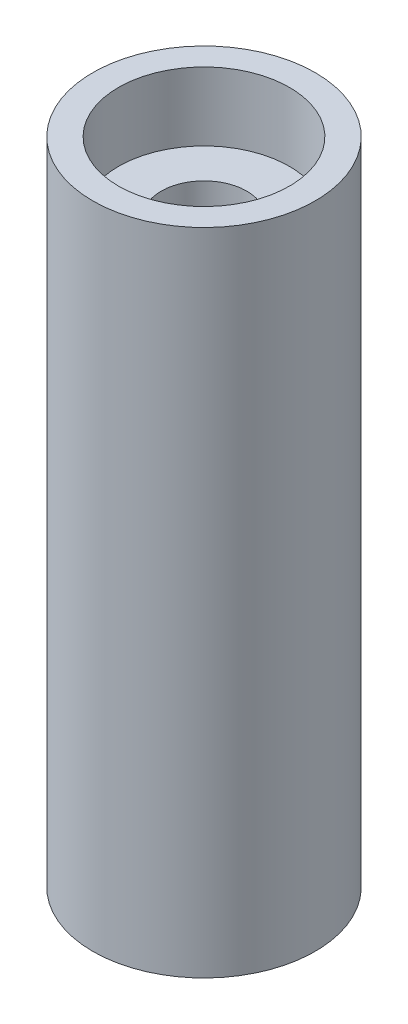
ISO-10303-21;
HEADER;
FILE_DESCRIPTION(('STEP AP214'),'2;1');
FILE_NAME('part.step','',(''),(''),'','','');
FILE_SCHEMA(('AUTOMOTIVE_DESIGN { 1 0 10303 214 1 1 1 1 }'));
ENDSEC;
DATA;
#1=APPLICATION_CONTEXT('core data for automotive mechanical design processes');
#2=APPLICATION_PROTOCOL_DEFINITION('international standard','automotive_design',2000,#1);
#3=PRODUCT_CONTEXT('',#1,'mechanical');
#4=PRODUCT('Part','Part','',(#3));
#5=PRODUCT_RELATED_PRODUCT_CATEGORY('part','',(#4));
#6=PRODUCT_DEFINITION_FORMATION('','',#4);
#7=PRODUCT_DEFINITION_CONTEXT('part definition',#1,'design');
#8=PRODUCT_DEFINITION('design','',#6,#7);
#9=PRODUCT_DEFINITION_SHAPE('','',#8);
#10=(LENGTH_UNIT() NAMED_UNIT(*) SI_UNIT(.MILLI.,.METRE.));
#11=(NAMED_UNIT(*) PLANE_ANGLE_UNIT() SI_UNIT($,.RADIAN.));
#12=(NAMED_UNIT(*) SI_UNIT($,.STERADIAN.) SOLID_ANGLE_UNIT());
#13=UNCERTAINTY_MEASURE_WITH_UNIT(LENGTH_MEASURE(1.E-05),#10,'distance_accuracy_value','');
#14=(GEOMETRIC_REPRESENTATION_CONTEXT(3) GLOBAL_UNCERTAINTY_ASSIGNED_CONTEXT((#13)) GLOBAL_UNIT_ASSIGNED_CONTEXT((#10,
#11,#12)) REPRESENTATION_CONTEXT('',''));
#15=CARTESIAN_POINT('',(0.,0.,0.));
#16=DIRECTION('',(0.,0.,1.));
#17=DIRECTION('',(1.,0.,0.));
#18=AXIS2_PLACEMENT_3D('',#15,#16,#17);
#19=CARTESIAN_POINT('',(0.,19.,0.));
#20=DIRECTION('',(0.,-1.,0.));
#21=DIRECTION('',(0.,0.,-1.));
#22=AXIS2_PLACEMENT_3D('',#19,#20,#21);
#23=CYLINDRICAL_SURFACE('',#22,2.5);
#24=CARTESIAN_POINT('',(0.,15.,0.));
#25=DIRECTION('',(0.,1.,0.));
#26=DIRECTION('',(0.,0.,1.));
#27=AXIS2_PLACEMENT_3D('',#24,#25,#26);
#28=CIRCLE('',#27,2.5);
#29=CARTESIAN_POINT('',(0.,15.,2.5));
#30=VERTEX_POINT('',#29);
#31=EDGE_CURVE('E54',#30,#30,#28,.T.);
#32=ORIENTED_EDGE('',*,*,#31,.T.);
#33=EDGE_LOOP('',(#32));
#34=FACE_BOUND('',#33,.T.);
#35=CARTESIAN_POINT('',(0.,-15.,0.));
#36=DIRECTION('',(0.,-1.,0.));
#37=DIRECTION('',(0.,0.,-1.));
#38=AXIS2_PLACEMENT_3D('',#35,#36,#37);
#39=CIRCLE('',#38,2.5);
#40=CARTESIAN_POINT('',(0.,-15.,-2.5));
#41=VERTEX_POINT('',#40);
#42=EDGE_CURVE('E42',#41,#41,#39,.T.);
#43=ORIENTED_EDGE('',*,*,#42,.T.);
#44=EDGE_LOOP('',(#43));
#45=FACE_BOUND('',#44,.T.);
#46=ADVANCED_FACE('F38',(#34,#45),#23,.F.);
#47=CARTESIAN_POINT('',(0.,-19.,0.));
#48=DIRECTION('',(0.,1.,0.));
#49=DIRECTION('',(0.,0.,1.));
#50=AXIS2_PLACEMENT_3D('',#47,#48,#49);
#51=PLANE('',#50);
#52=CARTESIAN_POINT('',(0.,-19.,0.));
#53=DIRECTION('',(0.,1.,0.));
#54=DIRECTION('',(0.,0.,1.));
#55=AXIS2_PLACEMENT_3D('',#52,#53,#54);
#56=CIRCLE('',#55,6.5);
#57=CARTESIAN_POINT('',(0.,-19.,6.5));
#58=VERTEX_POINT('',#57);
#59=EDGE_CURVE('E47',#58,#58,#56,.T.);
#60=ORIENTED_EDGE('',*,*,#59,.F.);
#61=EDGE_LOOP('',(#60));
#62=FACE_BOUND('',#61,.T.);
#63=CARTESIAN_POINT('',(0.,-19.,0.));
#64=DIRECTION('',(0.,1.,0.));
#65=DIRECTION('',(0.,0.,1.));
#66=AXIS2_PLACEMENT_3D('',#63,#64,#65);
#67=CIRCLE('',#66,5.);
#68=CARTESIAN_POINT('',(0.,-19.,5.));
#69=VERTEX_POINT('',#68);
#70=EDGE_CURVE('E72',#69,#69,#67,.T.);
#71=ORIENTED_EDGE('',*,*,#70,.T.);
#72=EDGE_LOOP('',(#71));
#73=FACE_BOUND('',#72,.T.);
#74=ADVANCED_FACE('F95',(#62,#73),#51,.F.);
#75=CARTESIAN_POINT('',(0.,19.,0.));
#76=DIRECTION('',(0.,1.,0.));
#77=DIRECTION('',(0.,0.,1.));
#78=AXIS2_PLACEMENT_3D('',#75,#76,#77);
#79=PLANE('',#78);
#80=CARTESIAN_POINT('',(0.,19.,0.));
#81=DIRECTION('',(0.,1.,0.));
#82=DIRECTION('',(0.,0.,1.));
#83=AXIS2_PLACEMENT_3D('',#80,#81,#82);
#84=CIRCLE('',#83,5.);
#85=CARTESIAN_POINT('',(0.,19.,5.));
#86=VERTEX_POINT('',#85);
#87=EDGE_CURVE('E57',#86,#86,#84,.T.);
#88=ORIENTED_EDGE('',*,*,#87,.F.);
#89=EDGE_LOOP('',(#88));
#90=FACE_BOUND('',#89,.T.);
#91=CARTESIAN_POINT('',(0.,19.,0.));
#92=DIRECTION('',(0.,1.,0.));
#93=DIRECTION('',(0.,0.,1.));
#94=AXIS2_PLACEMENT_3D('',#91,#92,#93);
#95=CIRCLE('',#94,6.5);
#96=CARTESIAN_POINT('',(0.,19.,6.5));
#97=VERTEX_POINT('',#96);
#98=EDGE_CURVE('E10',#97,#97,#95,.T.);
#99=ORIENTED_EDGE('',*,*,#98,.T.);
#100=EDGE_LOOP('',(#99));
#101=FACE_BOUND('',#100,.T.);
#102=ADVANCED_FACE('F100',(#90,#101),#79,.T.);
#103=CARTESIAN_POINT('',(0.,19.,0.));
#104=DIRECTION('',(0.,-1.,0.));
#105=DIRECTION('',(0.,0.,-1.));
#106=AXIS2_PLACEMENT_3D('',#103,#104,#105);
#107=CYLINDRICAL_SURFACE('',#106,6.5);
#108=ORIENTED_EDGE('',*,*,#98,.F.);
#109=EDGE_LOOP('',(#108));
#110=FACE_BOUND('',#109,.T.);
#111=ORIENTED_EDGE('',*,*,#59,.T.);
#112=EDGE_LOOP('',(#111));
#113=FACE_BOUND('',#112,.T.);
#114=ADVANCED_FACE('F40',(#110,#113),#107,.T.);
#115=CARTESIAN_POINT('',(0.,15.,0.));
#116=DIRECTION('',(0.,1.,0.));
#117=DIRECTION('',(0.,0.,1.));
#118=AXIS2_PLACEMENT_3D('',#115,#116,#117);
#119=CYLINDRICAL_SURFACE('',#118,5.);
#120=CARTESIAN_POINT('',(0.,15.,0.));
#121=DIRECTION('',(0.,1.,0.));
#122=DIRECTION('',(0.,0.,1.));
#123=AXIS2_PLACEMENT_3D('',#120,#121,#122);
#124=CIRCLE('',#123,5.);
#125=CARTESIAN_POINT('',(0.,15.,5.));
#126=VERTEX_POINT('',#125);
#127=EDGE_CURVE('E61',#126,#126,#124,.T.);
#128=ORIENTED_EDGE('',*,*,#127,.F.);
#129=EDGE_LOOP('',(#128));
#130=FACE_BOUND('',#129,.T.);
#131=ORIENTED_EDGE('',*,*,#87,.T.);
#132=EDGE_LOOP('',(#131));
#133=FACE_BOUND('',#132,.T.);
#134=ADVANCED_FACE('F104',(#130,#133),#119,.F.);
#135=CARTESIAN_POINT('',(0.,15.,0.));
#136=DIRECTION('',(0.,1.,0.));
#137=DIRECTION('',(0.,0.,1.));
#138=AXIS2_PLACEMENT_3D('',#135,#136,#137);
#139=PLANE('',#138);
#140=ORIENTED_EDGE('',*,*,#31,.F.);
#141=EDGE_LOOP('',(#140));
#142=FACE_BOUND('',#141,.T.);
#143=ORIENTED_EDGE('',*,*,#127,.T.);
#144=EDGE_LOOP('',(#143));
#145=FACE_BOUND('',#144,.T.);
#146=ADVANCED_FACE('F92',(#142,#145),#139,.T.);
#147=CARTESIAN_POINT('',(0.,-15.,0.));
#148=DIRECTION('',(0.,-1.,0.));
#149=DIRECTION('',(0.,0.,-1.));
#150=AXIS2_PLACEMENT_3D('',#147,#148,#149);
#151=CYLINDRICAL_SURFACE('',#150,5.);
#152=CARTESIAN_POINT('',(0.,-15.,0.));
#153=DIRECTION('',(0.,1.,0.));
#154=DIRECTION('',(0.,0.,1.));
#155=AXIS2_PLACEMENT_3D('',#152,#153,#154);
#156=CIRCLE('',#155,5.);
#157=CARTESIAN_POINT('',(0.,-15.,5.));
#158=VERTEX_POINT('',#157);
#159=EDGE_CURVE('E76',#158,#158,#156,.T.);
#160=ORIENTED_EDGE('',*,*,#159,.T.);
#161=EDGE_LOOP('',(#160));
#162=FACE_BOUND('',#161,.T.);
#163=ORIENTED_EDGE('',*,*,#70,.F.);
#164=EDGE_LOOP('',(#163));
#165=FACE_BOUND('',#164,.T.);
#166=ADVANCED_FACE('F87',(#162,#165),#151,.F.);
#167=CARTESIAN_POINT('',(0.,-15.,0.));
#168=DIRECTION('',(0.,-1.,0.));
#169=DIRECTION('',(0.,0.,1.));
#170=AXIS2_PLACEMENT_3D('',#167,#168,#169);
#171=PLANE('',#170);
#172=ORIENTED_EDGE('',*,*,#42,.F.);
#173=EDGE_LOOP('',(#172));
#174=FACE_BOUND('',#173,.T.);
#175=ORIENTED_EDGE('',*,*,#159,.F.);
#176=EDGE_LOOP('',(#175));
#177=FACE_BOUND('',#176,.T.);
#178=ADVANCED_FACE('F84',(#174,#177),#171,.T.);
#179=CLOSED_SHELL('',(#46,#74,#102,#114,#134,#146,#166,#178));
#180=MANIFOLD_SOLID_BREP('B2',#179);
#181=ADVANCED_BREP_SHAPE_REPRESENTATION('',(#18,#180),#14);
#182=SHAPE_DEFINITION_REPRESENTATION(#9,#181);
ENDSEC;
END-ISO-10303-21;
